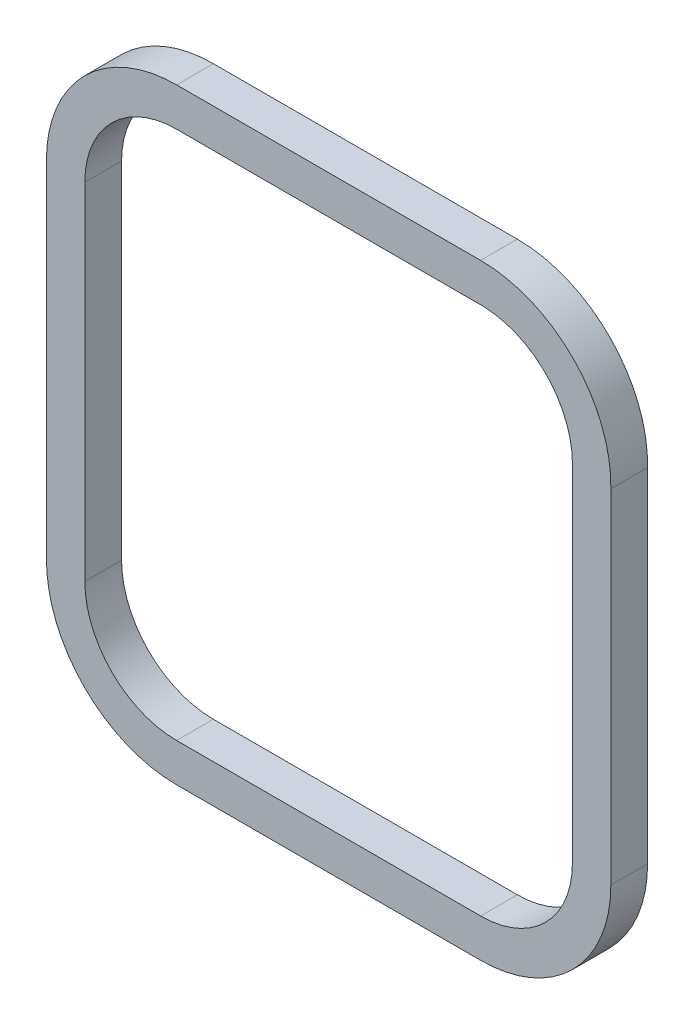
ISO-10303-21;
HEADER;
FILE_DESCRIPTION(('STEP AP214'),'2;1');
FILE_NAME('part.step','',(''),(''),'','','');
FILE_SCHEMA(('AUTOMOTIVE_DESIGN { 1 0 10303 214 1 1 1 1 }'));
ENDSEC;
DATA;
#1=APPLICATION_CONTEXT('core data for automotive mechanical design processes');
#2=APPLICATION_PROTOCOL_DEFINITION('international standard','automotive_design',2000,#1);
#3=PRODUCT_CONTEXT('',#1,'mechanical');
#4=PRODUCT('Part','Part','',(#3));
#5=PRODUCT_RELATED_PRODUCT_CATEGORY('part','',(#4));
#6=PRODUCT_DEFINITION_FORMATION('','',#4);
#7=PRODUCT_DEFINITION_CONTEXT('part definition',#1,'design');
#8=PRODUCT_DEFINITION('design','',#6,#7);
#9=PRODUCT_DEFINITION_SHAPE('','',#8);
#10=(LENGTH_UNIT() NAMED_UNIT(*) SI_UNIT(.MILLI.,.METRE.));
#11=(NAMED_UNIT(*) PLANE_ANGLE_UNIT() SI_UNIT($,.RADIAN.));
#12=(NAMED_UNIT(*) SI_UNIT($,.STERADIAN.) SOLID_ANGLE_UNIT());
#13=UNCERTAINTY_MEASURE_WITH_UNIT(LENGTH_MEASURE(1.E-05),#10,'distance_accuracy_value','');
#14=(GEOMETRIC_REPRESENTATION_CONTEXT(3) GLOBAL_UNCERTAINTY_ASSIGNED_CONTEXT((#13)) GLOBAL_UNIT_ASSIGNED_CONTEXT((#10,
#11,#12)) REPRESENTATION_CONTEXT('',''));
#15=CARTESIAN_POINT('',(0.,0.,0.));
#16=DIRECTION('',(0.,0.,1.));
#17=DIRECTION('',(1.,0.,0.));
#18=AXIS2_PLACEMENT_3D('',#15,#16,#17);
#19=CARTESIAN_POINT('',(7.85141929922826,10.3499823335088,2.2));
#20=DIRECTION('',(0.,0.,-1.));
#21=DIRECTION('',(-1.,0.,0.));
#22=AXIS2_PLACEMENT_3D('',#19,#20,#21);
#23=PLANE('',#22);
#24=CARTESIAN_POINT('',(7.85141929922826,10.3499823335088,2.2));
#25=DIRECTION('',(0.,0.,1.));
#26=DIRECTION('',(-1.,0.,0.));
#27=AXIS2_PLACEMENT_3D('',#24,#25,#26);
#28=CIRCLE('',#27,7.79998289698273);
#29=CARTESIAN_POINT('',(15.64999864923,10.2020184360531,2.2));
#30=VERTEX_POINT('',#29);
#31=CARTESIAN_POINT('',(7.84999864276148,18.1499651011153,2.2));
#32=VERTEX_POINT('',#31);
#33=EDGE_CURVE('E215',#30,#32,#28,.T.);
#34=ORIENTED_EDGE('',*,*,#33,.T.);
#35=DIRECTION('',(-0.999999999998339,1.82253363950905E-06,0.));
#36=VECTOR('',#35,1.);
#37=CARTESIAN_POINT('',(-10.3499871414758,18.1499982712017,2.2));
#38=LINE('',#37,#36);
#39=CARTESIAN_POINT('',(-10.3499871414758,18.1499982712017,2.2));
#40=VERTEX_POINT('',#39);
#41=EDGE_CURVE('E218',#32,#40,#38,.T.);
#42=ORIENTED_EDGE('',*,*,#41,.T.);
#43=CARTESIAN_POINT('',(-10.3500013572382,10.3499982712144,2.2));
#44=DIRECTION('',(0.,0.,1.));
#45=DIRECTION('',(-1.,0.,0.));
#46=AXIS2_PLACEMENT_3D('',#43,#44,#45);
#47=CIRCLE('',#46,7.80000000000025);
#48=CARTESIAN_POINT('',(-18.1500013572385,10.3499979302658,2.2));
#49=VERTEX_POINT('',#48);
#50=EDGE_CURVE('E221',#40,#49,#47,.T.);
#51=ORIENTED_EDGE('',*,*,#50,.T.);
#52=DIRECTION('',(0.,-1.,0.));
#53=VECTOR('',#52,1.);
#54=CARTESIAN_POINT('',(-18.1500013572385,10.3499979302658,2.2));
#55=LINE('',#54,#53);
#56=CARTESIAN_POINT('',(-18.1500013572385,-10.3500000284124,2.2));
#57=VERTEX_POINT('',#56);
#58=EDGE_CURVE('E223',#49,#57,#55,.T.);
#59=ORIENTED_EDGE('',*,*,#58,.T.);
#60=CARTESIAN_POINT('',(-10.3500004524127,-10.3500000284124,2.2));
#61=DIRECTION('',(0.,0.,1.));
#62=DIRECTION('',(1.,0.,0.));
#63=AXIS2_PLACEMENT_3D('',#60,#61,#62);
#64=CIRCLE('',#63,7.80000090482574);
#65=CARTESIAN_POINT('',(-10.3500004524127,-18.1500009332381,2.2));
#66=VERTEX_POINT('',#65);
#67=EDGE_CURVE('E225',#57,#66,#64,.T.);
#68=ORIENTED_EDGE('',*,*,#67,.T.);
#69=DIRECTION('',(1.,0.,0.));
#70=VECTOR('',#69,1.);
#71=CARTESIAN_POINT('',(-10.3500004524127,-18.1500009332381,2.2));
#72=LINE('',#71,#70);
#73=CARTESIAN_POINT('',(7.84999954758719,-18.1500009332381,2.2));
#74=VERTEX_POINT('',#73);
#75=EDGE_CURVE('E227',#66,#74,#72,.T.);
#76=ORIENTED_EDGE('',*,*,#75,.T.);
#77=CARTESIAN_POINT('',(7.84999954758719,-10.3500009332381,2.2));
#78=DIRECTION('',(0.,0.,1.));
#79=DIRECTION('',(-1.,0.,0.));
#80=AXIS2_PLACEMENT_3D('',#77,#78,#79);
#81=CIRCLE('',#80,7.80000000000004);
#82=CARTESIAN_POINT('',(15.6499995475872,-10.3500005922893,2.2));
#83=VERTEX_POINT('',#82);
#84=EDGE_CURVE('E229',#74,#83,#81,.T.);
#85=ORIENTED_EDGE('',*,*,#84,.T.);
#86=DIRECTION('',(-4.37113876392882E-08,0.999999999999999,0.));
#87=VECTOR('',#86,1.);
#88=CARTESIAN_POINT('',(15.6499995475872,-10.3500005922893,2.2));
#89=LINE('',#88,#87);
#90=EDGE_CURVE('E231',#83,#30,#89,.T.);
#91=ORIENTED_EDGE('',*,*,#90,.T.);
#92=EDGE_LOOP('',(#34,#42,#51,#59,#68,#76,#85,#91));
#93=FACE_BOUND('',#92,.T.);
#94=CARTESIAN_POINT('',(-10.3500002120002,10.3499990667619,2.2));
#95=DIRECTION('',(0.,0.,1.));
#96=DIRECTION('',(-1.,0.,0.));
#97=AXIS2_PLACEMENT_3D('',#94,#95,#96);
#98=CIRCLE('',#97,5.50000024041266);
#99=CARTESIAN_POINT('',(-10.3488787810029,15.8499991928466,2.2));
#100=VERTEX_POINT('',#99);
#101=CARTESIAN_POINT('',(-15.8500004524129,10.3499990667619,2.2));
#102=VERTEX_POINT('',#101);
#103=EDGE_CURVE('E150',#100,#102,#98,.T.);
#104=ORIENTED_EDGE('',*,*,#103,.F.);
#105=DIRECTION('',(-0.999999979213101,0.000203896536046961,0.));
#106=VECTOR('',#105,1.);
#107=CARTESIAN_POINT('',(-10.3488787810029,15.8499991928466,2.2));
#108=LINE('',#107,#106);
#109=CARTESIAN_POINT('',(8.05312906000272,15.8462470871135,2.2));
#110=VERTEX_POINT('',#109);
#111=EDGE_CURVE('E183',#110,#100,#108,.T.);
#112=ORIENTED_EDGE('',*,*,#111,.F.);
#113=CARTESIAN_POINT('',(7.8499986427615,10.3499994549928,2.2));
#114=DIRECTION('',(0.,0.,1.));
#115=DIRECTION('',(-1.,0.,0.));
#116=AXIS2_PLACEMENT_3D('',#113,#114,#115);
#117=CIRCLE('',#116,5.50000000000001);
#118=CARTESIAN_POINT('',(13.3499986427615,10.3499993071745,2.2));
#119=VERTEX_POINT('',#118);
#120=EDGE_CURVE('E181',#119,#110,#117,.T.);
#121=ORIENTED_EDGE('',*,*,#120,.F.);
#122=DIRECTION('',(0.,1.,0.));
#123=VECTOR('',#122,1.);
#124=CARTESIAN_POINT('',(13.3499986427615,-10.3500006928256,2.2));
#125=LINE('',#124,#123);
#126=CARTESIAN_POINT('',(13.3499986427615,-10.3500006928256,2.2));
#127=VERTEX_POINT('',#126);
#128=EDGE_CURVE('E179',#127,#119,#125,.T.);
#129=ORIENTED_EDGE('',*,*,#128,.F.);
#130=CARTESIAN_POINT('',(7.84999864276151,-10.3500006928256,2.2));
#131=DIRECTION('',(0.,0.,1.));
#132=DIRECTION('',(1.,0.,0.));
#133=AXIS2_PLACEMENT_3D('',#130,#131,#132);
#134=CIRCLE('',#133,5.5);
#135=CARTESIAN_POINT('',(7.84999954758728,-15.8500006928255,2.2));
#136=VERTEX_POINT('',#135);
#137=EDGE_CURVE('E177',#136,#127,#134,.T.);
#138=ORIENTED_EDGE('',*,*,#137,.F.);
#139=DIRECTION('',(1.,0.,0.));
#140=VECTOR('',#139,1.);
#141=CARTESIAN_POINT('',(-10.3499997879998,-15.8500006928255,2.2));
#142=LINE('',#141,#140);
#143=CARTESIAN_POINT('',(-10.3499997879998,-15.8500006928255,2.2));
#144=VERTEX_POINT('',#143);
#145=EDGE_CURVE('E173',#144,#136,#142,.T.);
#146=ORIENTED_EDGE('',*,*,#145,.F.);
#147=CARTESIAN_POINT('',(-10.3499997879998,-10.3500000284125,2.2));
#148=DIRECTION('',(0.,0.,1.));
#149=DIRECTION('',(1.,0.,0.));
#150=AXIS2_PLACEMENT_3D('',#147,#148,#149);
#151=CIRCLE('',#150,5.500000664413);
#152=CARTESIAN_POINT('',(-15.8500004524129,-10.3500000284125,2.2));
#153=VERTEX_POINT('',#152);
#154=EDGE_CURVE('E171',#153,#144,#151,.T.);
#155=ORIENTED_EDGE('',*,*,#154,.F.);
#156=DIRECTION('',(0.,-1.,0.));
#157=VECTOR('',#156,1.);
#158=CARTESIAN_POINT('',(-15.8500004524129,10.3499990667619,2.2));
#159=LINE('',#158,#157);
#160=EDGE_CURVE('E158',#102,#153,#159,.T.);
#161=ORIENTED_EDGE('',*,*,#160,.F.);
#162=EDGE_LOOP('',(#104,#112,#121,#129,#138,#146,#155,#161));
#163=FACE_BOUND('',#162,.T.);
#164=ADVANCED_FACE('F37',(#93,#163),#23,.F.);
#165=CARTESIAN_POINT('',(7.85141929922826,10.3499823335088,0.));
#166=DIRECTION('',(0.,0.,-1.));
#167=DIRECTION('',(-1.,0.,0.));
#168=AXIS2_PLACEMENT_3D('',#165,#166,#167);
#169=PLANE('',#168);
#170=CARTESIAN_POINT('',(7.85141929922826,10.3499823335088,0.));
#171=DIRECTION('',(0.,0.,1.));
#172=DIRECTION('',(-1.,0.,0.));
#173=AXIS2_PLACEMENT_3D('',#170,#171,#172);
#174=CIRCLE('',#173,7.79998289698273);
#175=CARTESIAN_POINT('',(15.64999864923,10.2020184360531,0.));
#176=VERTEX_POINT('',#175);
#177=CARTESIAN_POINT('',(7.84999864276148,18.1499651011153,0.));
#178=VERTEX_POINT('',#177);
#179=EDGE_CURVE('E166',#176,#178,#174,.T.);
#180=ORIENTED_EDGE('',*,*,#179,.F.);
#181=DIRECTION('',(-4.37113876392882E-08,0.999999999999999,0.));
#182=VECTOR('',#181,1.);
#183=CARTESIAN_POINT('',(15.6499995475872,-10.3500005922893,0.));
#184=LINE('',#183,#182);
#185=CARTESIAN_POINT('',(15.6499995475872,-10.3500005922893,0.));
#186=VERTEX_POINT('',#185);
#187=EDGE_CURVE('E219',#186,#176,#184,.T.);
#188=ORIENTED_EDGE('',*,*,#187,.F.);
#189=CARTESIAN_POINT('',(7.84999954758719,-10.3500009332381,0.));
#190=DIRECTION('',(0.,0.,1.));
#191=DIRECTION('',(-1.,0.,0.));
#192=AXIS2_PLACEMENT_3D('',#189,#190,#191);
#193=CIRCLE('',#192,7.80000000000004);
#194=CARTESIAN_POINT('',(7.84999954758719,-18.1500009332381,0.));
#195=VERTEX_POINT('',#194);
#196=EDGE_CURVE('E246',#195,#186,#193,.T.);
#197=ORIENTED_EDGE('',*,*,#196,.F.);
#198=DIRECTION('',(1.,0.,0.));
#199=VECTOR('',#198,1.);
#200=CARTESIAN_POINT('',(-10.3500004524127,-18.1500009332381,0.));
#201=LINE('',#200,#199);
#202=CARTESIAN_POINT('',(-10.3500004524127,-18.1500009332381,0.));
#203=VERTEX_POINT('',#202);
#204=EDGE_CURVE('E244',#203,#195,#201,.T.);
#205=ORIENTED_EDGE('',*,*,#204,.F.);
#206=CARTESIAN_POINT('',(-10.3500004524127,-10.3500000284124,0.));
#207=DIRECTION('',(0.,0.,1.));
#208=DIRECTION('',(1.,0.,0.));
#209=AXIS2_PLACEMENT_3D('',#206,#207,#208);
#210=CIRCLE('',#209,7.80000090482574);
#211=CARTESIAN_POINT('',(-18.1500013572385,-10.3500000284124,0.));
#212=VERTEX_POINT('',#211);
#213=EDGE_CURVE('E242',#212,#203,#210,.T.);
#214=ORIENTED_EDGE('',*,*,#213,.F.);
#215=DIRECTION('',(0.,-1.,0.));
#216=VECTOR('',#215,1.);
#217=CARTESIAN_POINT('',(-18.1500013572385,10.3499979302658,0.));
#218=LINE('',#217,#216);
#219=CARTESIAN_POINT('',(-18.1500013572385,10.3499979302658,0.));
#220=VERTEX_POINT('',#219);
#221=EDGE_CURVE('E240',#220,#212,#218,.T.);
#222=ORIENTED_EDGE('',*,*,#221,.F.);
#223=CARTESIAN_POINT('',(-10.3500013572382,10.3499982712144,0.));
#224=DIRECTION('',(0.,0.,1.));
#225=DIRECTION('',(-1.,0.,0.));
#226=AXIS2_PLACEMENT_3D('',#223,#224,#225);
#227=CIRCLE('',#226,7.80000000000025);
#228=CARTESIAN_POINT('',(-10.3499871414758,18.1499982712017,0.));
#229=VERTEX_POINT('',#228);
#230=EDGE_CURVE('E238',#229,#220,#227,.T.);
#231=ORIENTED_EDGE('',*,*,#230,.F.);
#232=DIRECTION('',(-0.999999999998339,1.82253363950905E-06,0.));
#233=VECTOR('',#232,1.);
#234=CARTESIAN_POINT('',(-10.3499871414758,18.1499982712017,0.));
#235=LINE('',#234,#233);
#236=EDGE_CURVE('E236',#178,#229,#235,.T.);
#237=ORIENTED_EDGE('',*,*,#236,.F.);
#238=EDGE_LOOP('',(#180,#188,#197,#205,#214,#222,#231,#237));
#239=FACE_BOUND('',#238,.T.);
#240=DIRECTION('',(-0.999999979213101,0.000203896536046961,0.));
#241=VECTOR('',#240,1.);
#242=CARTESIAN_POINT('',(-10.3488787810029,15.8499991928466,0.));
#243=LINE('',#242,#241);
#244=CARTESIAN_POINT('',(8.05312906000272,15.8462470871135,0.));
#245=VERTEX_POINT('',#244);
#246=CARTESIAN_POINT('',(-10.3488787810029,15.8499991928466,0.));
#247=VERTEX_POINT('',#246);
#248=EDGE_CURVE('E159',#245,#247,#243,.T.);
#249=ORIENTED_EDGE('',*,*,#248,.T.);
#250=CARTESIAN_POINT('',(-10.3500002120002,10.3499990667619,0.));
#251=DIRECTION('',(0.,0.,1.));
#252=DIRECTION('',(-1.,0.,0.));
#253=AXIS2_PLACEMENT_3D('',#250,#251,#252);
#254=CIRCLE('',#253,5.50000024041266);
#255=CARTESIAN_POINT('',(-15.8500004524129,10.3499990667619,0.));
#256=VERTEX_POINT('',#255);
#257=EDGE_CURVE('E60',#247,#256,#254,.T.);
#258=ORIENTED_EDGE('',*,*,#257,.T.);
#259=DIRECTION('',(0.,-1.,0.));
#260=VECTOR('',#259,1.);
#261=CARTESIAN_POINT('',(-15.8500004524129,10.3499990667619,0.));
#262=LINE('',#261,#260);
#263=CARTESIAN_POINT('',(-15.8500004524129,-10.3500000284125,0.));
#264=VERTEX_POINT('',#263);
#265=EDGE_CURVE('E165',#256,#264,#262,.T.);
#266=ORIENTED_EDGE('',*,*,#265,.T.);
#267=CARTESIAN_POINT('',(-10.3499997879998,-10.3500000284125,0.));
#268=DIRECTION('',(0.,0.,1.));
#269=DIRECTION('',(1.,0.,0.));
#270=AXIS2_PLACEMENT_3D('',#267,#268,#269);
#271=CIRCLE('',#270,5.500000664413);
#272=CARTESIAN_POINT('',(-10.3499997879998,-15.8500006928255,0.));
#273=VERTEX_POINT('',#272);
#274=EDGE_CURVE('E187',#264,#273,#271,.T.);
#275=ORIENTED_EDGE('',*,*,#274,.T.);
#276=DIRECTION('',(1.,0.,0.));
#277=VECTOR('',#276,1.);
#278=CARTESIAN_POINT('',(-10.3499997879998,-15.8500006928255,0.));
#279=LINE('',#278,#277);
#280=CARTESIAN_POINT('',(7.84999954758728,-15.8500006928255,0.));
#281=VERTEX_POINT('',#280);
#282=EDGE_CURVE('E190',#273,#281,#279,.T.);
#283=ORIENTED_EDGE('',*,*,#282,.T.);
#284=CARTESIAN_POINT('',(7.84999864276151,-10.3500006928256,0.));
#285=DIRECTION('',(0.,0.,1.));
#286=DIRECTION('',(1.,0.,0.));
#287=AXIS2_PLACEMENT_3D('',#284,#285,#286);
#288=CIRCLE('',#287,5.5);
#289=CARTESIAN_POINT('',(13.3499986427615,-10.3500006928256,0.));
#290=VERTEX_POINT('',#289);
#291=EDGE_CURVE('E193',#281,#290,#288,.T.);
#292=ORIENTED_EDGE('',*,*,#291,.T.);
#293=DIRECTION('',(0.,1.,0.));
#294=VECTOR('',#293,1.);
#295=CARTESIAN_POINT('',(13.3499986427615,-10.3500006928256,0.));
#296=LINE('',#295,#294);
#297=CARTESIAN_POINT('',(13.3499986427615,10.3499993071745,0.));
#298=VERTEX_POINT('',#297);
#299=EDGE_CURVE('E196',#290,#298,#296,.T.);
#300=ORIENTED_EDGE('',*,*,#299,.T.);
#301=CARTESIAN_POINT('',(7.8499986427615,10.3499994549928,0.));
#302=DIRECTION('',(0.,0.,1.));
#303=DIRECTION('',(-1.,0.,0.));
#304=AXIS2_PLACEMENT_3D('',#301,#302,#303);
#305=CIRCLE('',#304,5.50000000000001);
#306=EDGE_CURVE('E199',#298,#245,#305,.T.);
#307=ORIENTED_EDGE('',*,*,#306,.T.);
#308=EDGE_LOOP('',(#249,#258,#266,#275,#283,#292,#300,#307));
#309=FACE_BOUND('',#308,.T.);
#310=ADVANCED_FACE('F276',(#239,#309),#169,.T.);
#311=CARTESIAN_POINT('',(7.85141929922826,10.3499823335088,2.2));
#312=DIRECTION('',(0.,0.,-1.));
#313=DIRECTION('',(-1.,0.,0.));
#314=AXIS2_PLACEMENT_3D('',#311,#312,#313);
#315=CYLINDRICAL_SURFACE('',#314,7.79998289698273);
#316=ORIENTED_EDGE('',*,*,#179,.T.);
#317=DIRECTION('',(0.,0.,-1.));
#318=VECTOR('',#317,1.);
#319=CARTESIAN_POINT('',(7.84999864276148,18.1499651011153,2.2));
#320=LINE('',#319,#318);
#321=EDGE_CURVE('E11',#32,#178,#320,.T.);
#322=ORIENTED_EDGE('',*,*,#321,.F.);
#323=ORIENTED_EDGE('',*,*,#33,.F.);
#324=DIRECTION('',(0.,0.,-1.));
#325=VECTOR('',#324,1.);
#326=CARTESIAN_POINT('',(15.64999864923,10.2020184360531,2.2));
#327=LINE('',#326,#325);
#328=EDGE_CURVE('E233',#30,#176,#327,.T.);
#329=ORIENTED_EDGE('',*,*,#328,.T.);
#330=EDGE_LOOP('',(#316,#322,#323,#329));
#331=FACE_BOUND('',#330,.T.);
#332=ADVANCED_FACE('F39',(#331),#315,.T.);
#333=CARTESIAN_POINT('',(-10.3499871414758,18.1499982712017,2.2));
#334=DIRECTION('',(-1.82253363950905E-06,-0.999999999998339,0.));
#335=DIRECTION('',(0.999999999998339,-1.82253363950905E-06,0.));
#336=AXIS2_PLACEMENT_3D('',#333,#334,#335);
#337=PLANE('',#336);
#338=ORIENTED_EDGE('',*,*,#236,.T.);
#339=DIRECTION('',(0.,0.,-1.));
#340=VECTOR('',#339,1.);
#341=CARTESIAN_POINT('',(-10.3499871414758,18.1499982712017,2.2));
#342=LINE('',#341,#340);
#343=EDGE_CURVE('E45',#40,#229,#342,.T.);
#344=ORIENTED_EDGE('',*,*,#343,.F.);
#345=ORIENTED_EDGE('',*,*,#41,.F.);
#346=ORIENTED_EDGE('',*,*,#321,.T.);
#347=EDGE_LOOP('',(#338,#344,#345,#346));
#348=FACE_BOUND('',#347,.T.);
#349=ADVANCED_FACE('F293',(#348),#337,.F.);
#350=CARTESIAN_POINT('',(-10.3500013572382,10.3499982712144,2.2));
#351=DIRECTION('',(0.,0.,-1.));
#352=DIRECTION('',(-1.,0.,0.));
#353=AXIS2_PLACEMENT_3D('',#350,#351,#352);
#354=CYLINDRICAL_SURFACE('',#353,7.80000000000025);
#355=ORIENTED_EDGE('',*,*,#230,.T.);
#356=DIRECTION('',(0.,0.,-1.));
#357=VECTOR('',#356,1.);
#358=CARTESIAN_POINT('',(-18.1500013572385,10.3499979302658,2.2));
#359=LINE('',#358,#357);
#360=EDGE_CURVE('E263',#49,#220,#359,.T.);
#361=ORIENTED_EDGE('',*,*,#360,.F.);
#362=ORIENTED_EDGE('',*,*,#50,.F.);
#363=ORIENTED_EDGE('',*,*,#343,.T.);
#364=EDGE_LOOP('',(#355,#361,#362,#363));
#365=FACE_BOUND('',#364,.T.);
#366=ADVANCED_FACE('F270',(#365),#354,.T.);
#367=CARTESIAN_POINT('',(-18.1500013572385,10.3499979302658,2.2));
#368=DIRECTION('',(1.,0.,0.));
#369=DIRECTION('',(0.,0.,-1.));
#370=AXIS2_PLACEMENT_3D('',#367,#368,#369);
#371=PLANE('',#370);
#372=ORIENTED_EDGE('',*,*,#221,.T.);
#373=DIRECTION('',(0.,0.,-1.));
#374=VECTOR('',#373,1.);
#375=CARTESIAN_POINT('',(-18.1500013572385,-10.3500000284124,2.2));
#376=LINE('',#375,#374);
#377=EDGE_CURVE('E260',#57,#212,#376,.T.);
#378=ORIENTED_EDGE('',*,*,#377,.F.);
#379=ORIENTED_EDGE('',*,*,#58,.F.);
#380=ORIENTED_EDGE('',*,*,#360,.T.);
#381=EDGE_LOOP('',(#372,#378,#379,#380));
#382=FACE_BOUND('',#381,.T.);
#383=ADVANCED_FACE('F282',(#382),#371,.F.);
#384=CARTESIAN_POINT('',(-10.3500004524127,-10.3500000284124,2.2));
#385=DIRECTION('',(0.,0.,-1.));
#386=DIRECTION('',(-1.,0.,0.));
#387=AXIS2_PLACEMENT_3D('',#384,#385,#386);
#388=CYLINDRICAL_SURFACE('',#387,7.80000090482574);
#389=ORIENTED_EDGE('',*,*,#213,.T.);
#390=DIRECTION('',(0.,0.,-1.));
#391=VECTOR('',#390,1.);
#392=CARTESIAN_POINT('',(-10.3500004524127,-18.1500009332381,2.2));
#393=LINE('',#392,#391);
#394=EDGE_CURVE('E257',#66,#203,#393,.T.);
#395=ORIENTED_EDGE('',*,*,#394,.F.);
#396=ORIENTED_EDGE('',*,*,#67,.F.);
#397=ORIENTED_EDGE('',*,*,#377,.T.);
#398=EDGE_LOOP('',(#389,#395,#396,#397));
#399=FACE_BOUND('',#398,.T.);
#400=ADVANCED_FACE('F286',(#399),#388,.T.);
#401=CARTESIAN_POINT('',(-10.3500004524127,-18.1500009332381,2.2));
#402=DIRECTION('',(0.,1.,0.));
#403=DIRECTION('',(0.,0.,1.));
#404=AXIS2_PLACEMENT_3D('',#401,#402,#403);
#405=PLANE('',#404);
#406=ORIENTED_EDGE('',*,*,#204,.T.);
#407=DIRECTION('',(0.,0.,-1.));
#408=VECTOR('',#407,1.);
#409=CARTESIAN_POINT('',(7.84999954758719,-18.1500009332381,2.2));
#410=LINE('',#409,#408);
#411=EDGE_CURVE('E254',#74,#195,#410,.T.);
#412=ORIENTED_EDGE('',*,*,#411,.F.);
#413=ORIENTED_EDGE('',*,*,#75,.F.);
#414=ORIENTED_EDGE('',*,*,#394,.T.);
#415=EDGE_LOOP('',(#406,#412,#413,#414));
#416=FACE_BOUND('',#415,.T.);
#417=ADVANCED_FACE('F306',(#416),#405,.F.);
#418=CARTESIAN_POINT('',(7.84999954758719,-10.3500009332381,2.2));
#419=DIRECTION('',(0.,0.,-1.));
#420=DIRECTION('',(-1.,0.,0.));
#421=AXIS2_PLACEMENT_3D('',#418,#419,#420);
#422=CYLINDRICAL_SURFACE('',#421,7.80000000000004);
#423=ORIENTED_EDGE('',*,*,#196,.T.);
#424=DIRECTION('',(0.,0.,-1.));
#425=VECTOR('',#424,1.);
#426=CARTESIAN_POINT('',(15.6499995475872,-10.3500005922893,2.2));
#427=LINE('',#426,#425);
#428=EDGE_CURVE('E251',#83,#186,#427,.T.);
#429=ORIENTED_EDGE('',*,*,#428,.F.);
#430=ORIENTED_EDGE('',*,*,#84,.F.);
#431=ORIENTED_EDGE('',*,*,#411,.T.);
#432=EDGE_LOOP('',(#423,#429,#430,#431));
#433=FACE_BOUND('',#432,.T.);
#434=ADVANCED_FACE('F304',(#433),#422,.T.);
#435=CARTESIAN_POINT('',(15.6499995475872,-10.3500005922893,2.2));
#436=DIRECTION('',(-0.999999999999999,-4.37113876392882E-08,0.));
#437=DIRECTION('',(4.37113876392882E-08,-0.999999999999999,0.));
#438=AXIS2_PLACEMENT_3D('',#435,#436,#437);
#439=PLANE('',#438);
#440=ORIENTED_EDGE('',*,*,#187,.T.);
#441=ORIENTED_EDGE('',*,*,#328,.F.);
#442=ORIENTED_EDGE('',*,*,#90,.F.);
#443=ORIENTED_EDGE('',*,*,#428,.T.);
#444=EDGE_LOOP('',(#440,#441,#442,#443));
#445=FACE_BOUND('',#444,.T.);
#446=ADVANCED_FACE('F299',(#445),#439,.F.);
#447=CARTESIAN_POINT('',(-10.3500002120002,10.3499990667619,2.2));
#448=DIRECTION('',(0.,0.,-1.));
#449=DIRECTION('',(-1.,0.,0.));
#450=AXIS2_PLACEMENT_3D('',#447,#448,#449);
#451=CYLINDRICAL_SURFACE('',#450,5.50000024041266);
#452=ORIENTED_EDGE('',*,*,#257,.F.);
#453=DIRECTION('',(0.,0.,-1.));
#454=VECTOR('',#453,1.);
#455=CARTESIAN_POINT('',(-10.3488787810029,15.8499991928466,2.2));
#456=LINE('',#455,#454);
#457=EDGE_CURVE('E154',#100,#247,#456,.T.);
#458=ORIENTED_EDGE('',*,*,#457,.F.);
#459=ORIENTED_EDGE('',*,*,#103,.T.);
#460=DIRECTION('',(0.,0.,-1.));
#461=VECTOR('',#460,1.);
#462=CARTESIAN_POINT('',(-15.8500004524129,10.3499990667619,2.2));
#463=LINE('',#462,#461);
#464=EDGE_CURVE('E153',#102,#256,#463,.T.);
#465=ORIENTED_EDGE('',*,*,#464,.T.);
#466=EDGE_LOOP('',(#452,#458,#459,#465));
#467=FACE_BOUND('',#466,.T.);
#468=ADVANCED_FACE('F152',(#467),#451,.F.);
#469=CARTESIAN_POINT('',(-15.8500004524129,10.3499990667619,2.2));
#470=DIRECTION('',(1.,0.,0.));
#471=DIRECTION('',(0.,0.,-1.));
#472=AXIS2_PLACEMENT_3D('',#469,#470,#471);
#473=PLANE('',#472);
#474=ORIENTED_EDGE('',*,*,#265,.F.);
#475=ORIENTED_EDGE('',*,*,#464,.F.);
#476=ORIENTED_EDGE('',*,*,#160,.T.);
#477=DIRECTION('',(0.,0.,-1.));
#478=VECTOR('',#477,1.);
#479=CARTESIAN_POINT('',(-15.8500004524129,-10.3500000284125,2.2));
#480=LINE('',#479,#478);
#481=EDGE_CURVE('E167',#153,#264,#480,.T.);
#482=ORIENTED_EDGE('',*,*,#481,.T.);
#483=EDGE_LOOP('',(#474,#475,#476,#482));
#484=FACE_BOUND('',#483,.T.);
#485=ADVANCED_FACE('F162',(#484),#473,.T.);
#486=CARTESIAN_POINT('',(-10.3499997879998,-10.3500000284125,2.2));
#487=DIRECTION('',(0.,0.,-1.));
#488=DIRECTION('',(-1.,0.,0.));
#489=AXIS2_PLACEMENT_3D('',#486,#487,#488);
#490=CYLINDRICAL_SURFACE('',#489,5.500000664413);
#491=ORIENTED_EDGE('',*,*,#274,.F.);
#492=ORIENTED_EDGE('',*,*,#481,.F.);
#493=ORIENTED_EDGE('',*,*,#154,.T.);
#494=DIRECTION('',(0.,0.,-1.));
#495=VECTOR('',#494,1.);
#496=CARTESIAN_POINT('',(-10.3499997879998,-15.8500006928255,2.2));
#497=LINE('',#496,#495);
#498=EDGE_CURVE('E212',#144,#273,#497,.T.);
#499=ORIENTED_EDGE('',*,*,#498,.T.);
#500=EDGE_LOOP('',(#491,#492,#493,#499));
#501=FACE_BOUND('',#500,.T.);
#502=ADVANCED_FACE('F331',(#501),#490,.F.);
#503=CARTESIAN_POINT('',(-10.3499997879998,-15.8500006928255,2.2));
#504=DIRECTION('',(0.,1.,0.));
#505=DIRECTION('',(0.,0.,1.));
#506=AXIS2_PLACEMENT_3D('',#503,#504,#505);
#507=PLANE('',#506);
#508=ORIENTED_EDGE('',*,*,#282,.F.);
#509=ORIENTED_EDGE('',*,*,#498,.F.);
#510=ORIENTED_EDGE('',*,*,#145,.T.);
#511=DIRECTION('',(0.,0.,-1.));
#512=VECTOR('',#511,1.);
#513=CARTESIAN_POINT('',(7.84999954758728,-15.8500006928255,2.2));
#514=LINE('',#513,#512);
#515=EDGE_CURVE('E210',#136,#281,#514,.T.);
#516=ORIENTED_EDGE('',*,*,#515,.T.);
#517=EDGE_LOOP('',(#508,#509,#510,#516));
#518=FACE_BOUND('',#517,.T.);
#519=ADVANCED_FACE('F335',(#518),#507,.T.);
#520=CARTESIAN_POINT('',(7.84999864276151,-10.3500006928256,2.2));
#521=DIRECTION('',(0.,0.,-1.));
#522=DIRECTION('',(-1.,0.,0.));
#523=AXIS2_PLACEMENT_3D('',#520,#521,#522);
#524=CYLINDRICAL_SURFACE('',#523,5.5);
#525=ORIENTED_EDGE('',*,*,#291,.F.);
#526=ORIENTED_EDGE('',*,*,#515,.F.);
#527=ORIENTED_EDGE('',*,*,#137,.T.);
#528=DIRECTION('',(0.,0.,-1.));
#529=VECTOR('',#528,1.);
#530=CARTESIAN_POINT('',(13.3499986427615,-10.3500006928256,2.2));
#531=LINE('',#530,#529);
#532=EDGE_CURVE('E208',#127,#290,#531,.T.);
#533=ORIENTED_EDGE('',*,*,#532,.T.);
#534=EDGE_LOOP('',(#525,#526,#527,#533));
#535=FACE_BOUND('',#534,.T.);
#536=ADVANCED_FACE('F341',(#535),#524,.F.);
#537=CARTESIAN_POINT('',(13.3499986427615,-10.3500006928256,2.2));
#538=DIRECTION('',(-1.,0.,0.));
#539=DIRECTION('',(0.,0.,1.));
#540=AXIS2_PLACEMENT_3D('',#537,#538,#539);
#541=PLANE('',#540);
#542=ORIENTED_EDGE('',*,*,#299,.F.);
#543=ORIENTED_EDGE('',*,*,#532,.F.);
#544=ORIENTED_EDGE('',*,*,#128,.T.);
#545=DIRECTION('',(0.,0.,-1.));
#546=VECTOR('',#545,1.);
#547=CARTESIAN_POINT('',(13.3499986427615,10.3499993071745,2.2));
#548=LINE('',#547,#546);
#549=EDGE_CURVE('E206',#119,#298,#548,.T.);
#550=ORIENTED_EDGE('',*,*,#549,.T.);
#551=EDGE_LOOP('',(#542,#543,#544,#550));
#552=FACE_BOUND('',#551,.T.);
#553=ADVANCED_FACE('F345',(#552),#541,.T.);
#554=CARTESIAN_POINT('',(7.8499986427615,10.3499994549928,2.2));
#555=DIRECTION('',(0.,0.,-1.));
#556=DIRECTION('',(-1.,0.,0.));
#557=AXIS2_PLACEMENT_3D('',#554,#555,#556);
#558=CYLINDRICAL_SURFACE('',#557,5.50000000000001);
#559=ORIENTED_EDGE('',*,*,#306,.F.);
#560=ORIENTED_EDGE('',*,*,#549,.F.);
#561=ORIENTED_EDGE('',*,*,#120,.T.);
#562=DIRECTION('',(0.,0.,-1.));
#563=VECTOR('',#562,1.);
#564=CARTESIAN_POINT('',(8.05312906000272,15.8462470871135,2.2));
#565=LINE('',#564,#563);
#566=EDGE_CURVE('E52',#110,#245,#565,.T.);
#567=ORIENTED_EDGE('',*,*,#566,.T.);
#568=EDGE_LOOP('',(#559,#560,#561,#567));
#569=FACE_BOUND('',#568,.T.);
#570=ADVANCED_FACE('F349',(#569),#558,.F.);
#571=CARTESIAN_POINT('',(-10.3488787810029,15.8499991928466,2.2));
#572=DIRECTION('',(-0.000203896536046961,-0.999999979213101,0.));
#573=DIRECTION('',(0.999999979213101,-0.000203896536046961,0.));
#574=AXIS2_PLACEMENT_3D('',#571,#572,#573);
#575=PLANE('',#574);
#576=ORIENTED_EDGE('',*,*,#248,.F.);
#577=ORIENTED_EDGE('',*,*,#566,.F.);
#578=ORIENTED_EDGE('',*,*,#111,.T.);
#579=ORIENTED_EDGE('',*,*,#457,.T.);
#580=EDGE_LOOP('',(#576,#577,#578,#579));
#581=FACE_BOUND('',#580,.T.);
#582=ADVANCED_FACE('F353',(#581),#575,.T.);
#583=CLOSED_SHELL('',(#164,#310,#332,#349,#366,#383,#400,#417,#434,#446,#468,#485,#502,#519,
#536,#553,#570,#582));
#584=MANIFOLD_SOLID_BREP('B2',#583);
#585=ADVANCED_BREP_SHAPE_REPRESENTATION('',(#18,#584),#14);
#586=SHAPE_DEFINITION_REPRESENTATION(#9,#585);
ENDSEC;
END-ISO-10303-21;
